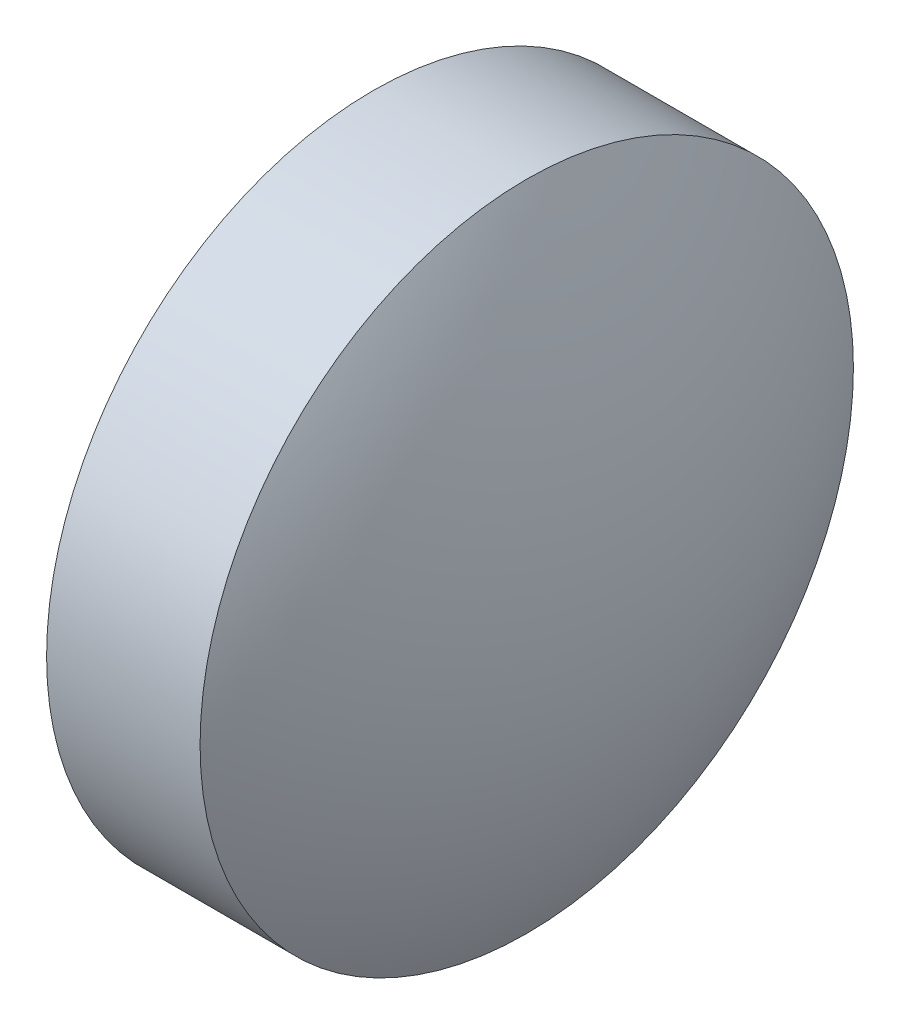
ISO-10303-21;
HEADER;
FILE_DESCRIPTION(('STEP AP214'),'2;1');
FILE_NAME('part.step','',(''),(''),'','','');
FILE_SCHEMA(('AUTOMOTIVE_DESIGN { 1 0 10303 214 1 1 1 1 }'));
ENDSEC;
DATA;
#1=APPLICATION_CONTEXT('core data for automotive mechanical design processes');
#2=APPLICATION_PROTOCOL_DEFINITION('international standard','automotive_design',2000,#1);
#3=PRODUCT_CONTEXT('',#1,'mechanical');
#4=PRODUCT('Part','Part','',(#3));
#5=PRODUCT_RELATED_PRODUCT_CATEGORY('part','',(#4));
#6=PRODUCT_DEFINITION_FORMATION('','',#4);
#7=PRODUCT_DEFINITION_CONTEXT('part definition',#1,'design');
#8=PRODUCT_DEFINITION('design','',#6,#7);
#9=PRODUCT_DEFINITION_SHAPE('','',#8);
#10=(LENGTH_UNIT() NAMED_UNIT(*) SI_UNIT(.MILLI.,.METRE.));
#11=(NAMED_UNIT(*) PLANE_ANGLE_UNIT() SI_UNIT($,.RADIAN.));
#12=(NAMED_UNIT(*) SI_UNIT($,.STERADIAN.) SOLID_ANGLE_UNIT());
#13=UNCERTAINTY_MEASURE_WITH_UNIT(LENGTH_MEASURE(1.E-05),#10,'distance_accuracy_value','');
#14=(GEOMETRIC_REPRESENTATION_CONTEXT(3) GLOBAL_UNCERTAINTY_ASSIGNED_CONTEXT((#13)) GLOBAL_UNIT_ASSIGNED_CONTEXT((#10,
#11,#12)) REPRESENTATION_CONTEXT('',''));
#15=CARTESIAN_POINT('',(0.,0.,0.));
#16=DIRECTION('',(0.,0.,1.));
#17=DIRECTION('',(1.,0.,0.));
#18=AXIS2_PLACEMENT_3D('',#15,#16,#17);
#19=CARTESIAN_POINT('',(528.153202986079,77.2205263725187,0.));
#20=DIRECTION('',(-1.,0.,0.));
#21=DIRECTION('',(0.,1.,0.));
#22=AXIS2_PLACEMENT_3D('',#19,#20,#21);
#23=SPHERICAL_SURFACE('',#22,6.46030487804872);
#24=CARTESIAN_POINT('',(533.793507864128,77.2205263725187,0.));
#25=DIRECTION('',(-1.,0.,0.));
#26=DIRECTION('',(0.,0.,1.));
#27=AXIS2_PLACEMENT_3D('',#24,#25,#26);
#28=CIRCLE('',#27,3.15);
#29=CARTESIAN_POINT('',(533.793507864128,77.2205263725187,3.15));
#30=VERTEX_POINT('',#29);
#31=EDGE_CURVE('E10',#30,#30,#28,.T.);
#32=ORIENTED_EDGE('',*,*,#31,.F.);
#33=EDGE_LOOP('',(#32));
#34=FACE_BOUND('',#33,.T.);
#35=ADVANCED_FACE('F35',(#34),#23,.T.);
#36=CARTESIAN_POINT('',(531.451879694543,77.2205263725187,0.));
#37=DIRECTION('',(-1.,0.,0.));
#38=DIRECTION('',(0.,0.,1.));
#39=AXIS2_PLACEMENT_3D('',#36,#37,#38);
#40=CYLINDRICAL_SURFACE('',#39,3.15);
#41=CARTESIAN_POINT('',(532.313507864128,77.2205263725187,0.));
#42=DIRECTION('',(-1.,0.,0.));
#43=DIRECTION('',(0.,0.,1.));
#44=AXIS2_PLACEMENT_3D('',#41,#42,#43);
#45=CIRCLE('',#44,3.15);
#46=CARTESIAN_POINT('',(532.313507864128,77.2205263725187,3.15));
#47=VERTEX_POINT('',#46);
#48=EDGE_CURVE('E41',#47,#47,#45,.T.);
#49=ORIENTED_EDGE('',*,*,#48,.F.);
#50=EDGE_LOOP('',(#49));
#51=FACE_BOUND('',#50,.T.);
#52=ORIENTED_EDGE('',*,*,#31,.T.);
#53=EDGE_LOOP('',(#52));
#54=FACE_BOUND('',#53,.T.);
#55=ADVANCED_FACE('F49',(#51,#54),#40,.T.);
#56=CARTESIAN_POINT('',(532.313507864128,77.2205263725187,0.));
#57=DIRECTION('',(1.,0.,0.));
#58=DIRECTION('',(0.,0.,-1.));
#59=AXIS2_PLACEMENT_3D('',#56,#57,#58);
#60=PLANE('',#59);
#61=ORIENTED_EDGE('',*,*,#48,.T.);
#62=EDGE_LOOP('',(#61));
#63=FACE_BOUND('',#62,.T.);
#64=ADVANCED_FACE('F47',(#63),#60,.F.);
#65=CLOSED_SHELL('',(#35,#55,#64));
#66=MANIFOLD_SOLID_BREP('B2',#65);
#67=ADVANCED_BREP_SHAPE_REPRESENTATION('',(#18,#66),#14);
#68=SHAPE_DEFINITION_REPRESENTATION(#9,#67);
ENDSEC;
END-ISO-10303-21;
